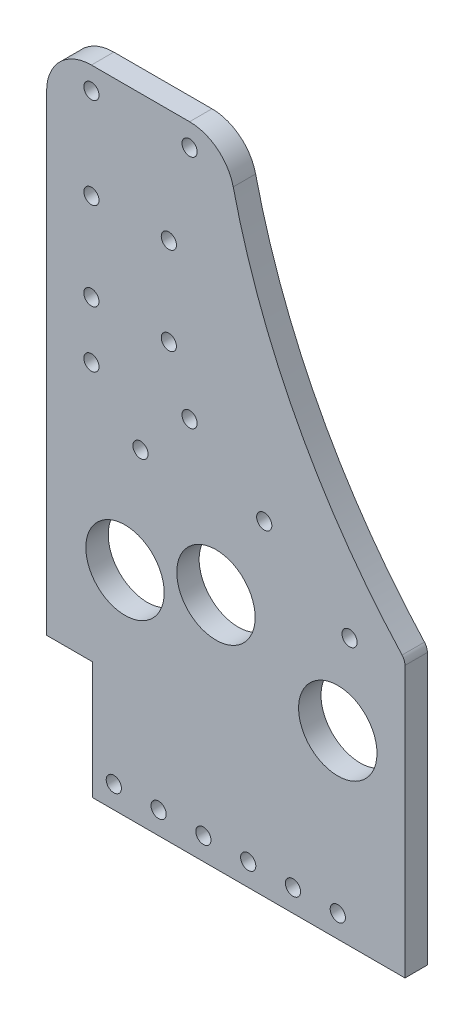
ISO-10303-21;
HEADER;
FILE_DESCRIPTION(('STEP AP214'),'2;1');
FILE_NAME('part.step','',(''),(''),'','','');
FILE_SCHEMA(('AUTOMOTIVE_DESIGN { 1 0 10303 214 1 1 1 1 }'));
ENDSEC;
DATA;
#1=APPLICATION_CONTEXT('core data for automotive mechanical design processes');
#2=APPLICATION_PROTOCOL_DEFINITION('international standard','automotive_design',2000,#1);
#3=PRODUCT_CONTEXT('',#1,'mechanical');
#4=PRODUCT('Part','Part','',(#3));
#5=PRODUCT_RELATED_PRODUCT_CATEGORY('part','',(#4));
#6=PRODUCT_DEFINITION_FORMATION('','',#4);
#7=PRODUCT_DEFINITION_CONTEXT('part definition',#1,'design');
#8=PRODUCT_DEFINITION('design','',#6,#7);
#9=PRODUCT_DEFINITION_SHAPE('','',#8);
#10=(LENGTH_UNIT() NAMED_UNIT(*) SI_UNIT(.MILLI.,.METRE.));
#11=(NAMED_UNIT(*) PLANE_ANGLE_UNIT() SI_UNIT($,.RADIAN.));
#12=(NAMED_UNIT(*) SI_UNIT($,.STERADIAN.) SOLID_ANGLE_UNIT());
#13=UNCERTAINTY_MEASURE_WITH_UNIT(LENGTH_MEASURE(1.E-05),#10,'distance_accuracy_value','');
#14=(GEOMETRIC_REPRESENTATION_CONTEXT(3) GLOBAL_UNCERTAINTY_ASSIGNED_CONTEXT((#13)) GLOBAL_UNIT_ASSIGNED_CONTEXT((#10,
#11,#12)) REPRESENTATION_CONTEXT('',''));
#15=CARTESIAN_POINT('',(0.,0.,0.));
#16=DIRECTION('',(0.,0.,1.));
#17=DIRECTION('',(1.,0.,0.));
#18=AXIS2_PLACEMENT_3D('',#15,#16,#17);
#19=CARTESIAN_POINT('',(46.1010000000001,208.28,-30.1625));
#20=DIRECTION('',(0.,0.,-1.));
#21=DIRECTION('',(-1.,0.,0.));
#22=AXIS2_PLACEMENT_3D('',#19,#20,#21);
#23=PLANE('',#22);
#24=CARTESIAN_POINT('',(68.0526412853853,188.834769871523,-30.1625));
#25=DIRECTION('',(0.,0.,-1.));
#26=DIRECTION('',(-1.,0.,0.));
#27=AXIS2_PLACEMENT_3D('',#24,#25,#26);
#28=CIRCLE('',#27,2.15265000000001);
#29=CARTESIAN_POINT('',(65.8999912853853,188.834769871523,-30.1625));
#30=VERTEX_POINT('',#29);
#31=EDGE_CURVE('E193',#30,#30,#28,.F.);
#32=ORIENTED_EDGE('',*,*,#31,.F.);
#33=EDGE_LOOP('',(#32));
#34=FACE_BOUND('',#33,.T.);
#35=CARTESIAN_POINT('',(68.0526412853853,163.971230128477,-30.1625));
#36=DIRECTION('',(0.,0.,-1.));
#37=DIRECTION('',(-1.,0.,0.));
#38=AXIS2_PLACEMENT_3D('',#35,#36,#37);
#39=CIRCLE('',#38,2.15265000000001);
#40=CARTESIAN_POINT('',(65.8999912853853,163.971230128477,-30.1625));
#41=VERTEX_POINT('',#40);
#42=EDGE_CURVE('E417',#41,#41,#39,.F.);
#43=ORIENTED_EDGE('',*,*,#42,.F.);
#44=EDGE_LOOP('',(#43));
#45=FACE_BOUND('',#44,.T.);
#46=CARTESIAN_POINT('',(46.1010000000002,163.971230128477,-30.1625));
#47=DIRECTION('',(0.,0.,-1.));
#48=DIRECTION('',(-1.,0.,0.));
#49=AXIS2_PLACEMENT_3D('',#46,#47,#48);
#50=CIRCLE('',#49,2.15265);
#51=CARTESIAN_POINT('',(43.9483500000002,163.971230128477,-30.1625));
#52=VERTEX_POINT('',#51);
#53=EDGE_CURVE('E420',#52,#52,#50,.F.);
#54=ORIENTED_EDGE('',*,*,#53,.F.);
#55=EDGE_LOOP('',(#54));
#56=FACE_BOUND('',#55,.T.);
#57=CARTESIAN_POINT('',(46.1010000000002,188.834769871523,-30.1625));
#58=DIRECTION('',(0.,0.,-1.));
#59=DIRECTION('',(-1.,0.,0.));
#60=AXIS2_PLACEMENT_3D('',#57,#58,#59);
#61=CIRCLE('',#60,2.15265);
#62=CARTESIAN_POINT('',(43.9483500000002,188.834769871523,-30.1625));
#63=VERTEX_POINT('',#62);
#64=EDGE_CURVE('E425',#63,#63,#61,.F.);
#65=ORIENTED_EDGE('',*,*,#64,.F.);
#66=EDGE_LOOP('',(#65));
#67=FACE_BOUND('',#66,.T.);
#68=CARTESIAN_POINT('',(52.4510000000001,47.6249999999999,-30.1625));
#69=DIRECTION('',(0.,0.,-1.));
#70=DIRECTION('',(-1.,0.,0.));
#71=AXIS2_PLACEMENT_3D('',#68,#69,#70);
#72=CIRCLE('',#71,2.15265000000001);
#73=CARTESIAN_POINT('',(50.2983500000001,47.6249999999999,-30.1625));
#74=VERTEX_POINT('',#73);
#75=EDGE_CURVE('E229',#74,#74,#72,.T.);
#76=ORIENTED_EDGE('',*,*,#75,.T.);
#77=EDGE_LOOP('',(#76));
#78=FACE_BOUND('',#77,.T.);
#79=CARTESIAN_POINT('',(65.1510000000001,47.6249999999999,-30.1625));
#80=DIRECTION('',(0.,0.,-1.));
#81=DIRECTION('',(-1.,0.,0.));
#82=AXIS2_PLACEMENT_3D('',#79,#80,#81);
#83=CIRCLE('',#82,2.15265000000001);
#84=CARTESIAN_POINT('',(62.9983500000001,47.6249999999999,-30.1625));
#85=VERTEX_POINT('',#84);
#86=EDGE_CURVE('E226',#85,#85,#83,.T.);
#87=ORIENTED_EDGE('',*,*,#86,.T.);
#88=EDGE_LOOP('',(#87));
#89=FACE_BOUND('',#88,.T.);
#90=CARTESIAN_POINT('',(77.8510000000001,47.6249999999999,-30.1625));
#91=DIRECTION('',(0.,0.,-1.));
#92=DIRECTION('',(-1.,0.,0.));
#93=AXIS2_PLACEMENT_3D('',#90,#91,#92);
#94=CIRCLE('',#93,2.15265000000001);
#95=CARTESIAN_POINT('',(75.6983500000001,47.6249999999999,-30.1625));
#96=VERTEX_POINT('',#95);
#97=EDGE_CURVE('E223',#96,#96,#94,.T.);
#98=ORIENTED_EDGE('',*,*,#97,.T.);
#99=EDGE_LOOP('',(#98));
#100=FACE_BOUND('',#99,.T.);
#101=CARTESIAN_POINT('',(90.5510000000001,47.6249999999999,-30.1625));
#102=DIRECTION('',(0.,0.,-1.));
#103=DIRECTION('',(-1.,0.,0.));
#104=AXIS2_PLACEMENT_3D('',#101,#102,#103);
#105=CIRCLE('',#104,2.15265000000001);
#106=CARTESIAN_POINT('',(88.3983500000001,47.6249999999999,-30.1625));
#107=VERTEX_POINT('',#106);
#108=EDGE_CURVE('E220',#107,#107,#105,.T.);
#109=ORIENTED_EDGE('',*,*,#108,.T.);
#110=EDGE_LOOP('',(#109));
#111=FACE_BOUND('',#110,.T.);
#112=CARTESIAN_POINT('',(103.251,47.6249999999999,-30.1625));
#113=DIRECTION('',(0.,0.,-1.));
#114=DIRECTION('',(-1.,0.,0.));
#115=AXIS2_PLACEMENT_3D('',#112,#113,#114);
#116=CIRCLE('',#115,2.15265000000001);
#117=CARTESIAN_POINT('',(101.09835,47.6249999999999,-30.1625));
#118=VERTEX_POINT('',#117);
#119=EDGE_CURVE('E216',#118,#118,#116,.T.);
#120=ORIENTED_EDGE('',*,*,#119,.T.);
#121=EDGE_LOOP('',(#120));
#122=FACE_BOUND('',#121,.T.);
#123=CARTESIAN_POINT('',(115.951,47.6249999999999,-30.1625));
#124=DIRECTION('',(0.,0.,-1.));
#125=DIRECTION('',(-1.,0.,0.));
#126=AXIS2_PLACEMENT_3D('',#123,#124,#125);
#127=CIRCLE('',#126,2.15265000000001);
#128=CARTESIAN_POINT('',(113.79835,47.6249999999999,-30.1625));
#129=VERTEX_POINT('',#128);
#130=EDGE_CURVE('E213',#129,#129,#127,.T.);
#131=ORIENTED_EDGE('',*,*,#130,.T.);
#132=EDGE_LOOP('',(#131));
#133=FACE_BOUND('',#132,.T.);
#134=DIRECTION('',(1.,0.,0.));
#135=VECTOR('',#134,1.);
#136=CARTESIAN_POINT('',(46.3550000000001,74.6125,-30.1625));
#137=LINE('',#136,#135);
#138=CARTESIAN_POINT('',(33.4010000000001,74.6125,-30.1625));
#139=VERTEX_POINT('',#138);
#140=CARTESIAN_POINT('',(46.3550000000001,74.6125,-30.1625));
#141=VERTEX_POINT('',#140);
#142=EDGE_CURVE('E171',#139,#141,#137,.T.);
#143=ORIENTED_EDGE('',*,*,#142,.T.);
#144=DIRECTION('',(0.,-1.,0.));
#145=VECTOR('',#144,1.);
#146=CARTESIAN_POINT('',(46.3550000000001,74.6125,-30.1625));
#147=LINE('',#146,#145);
#148=CARTESIAN_POINT('',(46.3550000000001,41.2749999999999,-30.1625));
#149=VERTEX_POINT('',#148);
#150=EDGE_CURVE('E108',#141,#149,#147,.T.);
#151=ORIENTED_EDGE('',*,*,#150,.T.);
#152=DIRECTION('',(1.,0.,0.));
#153=VECTOR('',#152,1.);
#154=CARTESIAN_POINT('',(46.3550000000001,41.2749999999999,-30.1625));
#155=LINE('',#154,#153);
#156=CARTESIAN_POINT('',(135.001,41.2749999999999,-30.1625));
#157=VERTEX_POINT('',#156);
#158=EDGE_CURVE('E293',#149,#157,#155,.T.);
#159=ORIENTED_EDGE('',*,*,#158,.T.);
#160=DIRECTION('',(0.,1.,0.));
#161=VECTOR('',#160,1.);
#162=CARTESIAN_POINT('',(135.001,73.152,-30.1625));
#163=LINE('',#162,#161);
#164=CARTESIAN_POINT('',(135.001,118.017245544849,-30.1625));
#165=VERTEX_POINT('',#164);
#166=EDGE_CURVE('E295',#157,#165,#163,.T.);
#167=ORIENTED_EDGE('',*,*,#166,.T.);
#168=CARTESIAN_POINT('',(131.826,118.017245544849,-30.1625));
#169=DIRECTION('',(0.,0.,1.));
#170=DIRECTION('',(1.,0.,0.));
#171=AXIS2_PLACEMENT_3D('',#168,#169,#170);
#172=CIRCLE('',#171,3.17500000000004);
#173=CARTESIAN_POINT('',(134.170615384616,120.158134074928,-30.1625));
#174=VERTEX_POINT('',#173);
#175=EDGE_CURVE('E297',#165,#174,#172,.T.);
#176=ORIENTED_EDGE('',*,*,#175,.T.);
#177=CARTESIAN_POINT('',(284.226,257.175,-30.1625));
#178=DIRECTION('',(0.,0.,-1.));
#179=DIRECTION('',(1.,0.,0.));
#180=AXIS2_PLACEMENT_3D('',#177,#178,#179);
#181=CIRCLE('',#180,203.2);
#182=CARTESIAN_POINT('',(86.3055415300155,211.156176470588,-30.1625));
#183=VERTEX_POINT('',#182);
#184=EDGE_CURVE('E299',#174,#183,#181,.T.);
#185=ORIENTED_EDGE('',*,*,#184,.T.);
#186=CARTESIAN_POINT('',(73.9355128756415,208.28,-30.1625));
#187=DIRECTION('',(0.,0.,1.));
#188=DIRECTION('',(1.,0.,0.));
#189=AXIS2_PLACEMENT_3D('',#186,#187,#188);
#190=CIRCLE('',#189,12.7);
#191=CARTESIAN_POINT('',(73.9355128756415,220.98,-30.1625));
#192=VERTEX_POINT('',#191);
#193=EDGE_CURVE('E133',#183,#192,#190,.T.);
#194=ORIENTED_EDGE('',*,*,#193,.T.);
#195=DIRECTION('',(-1.,0.,0.));
#196=VECTOR('',#195,1.);
#197=CARTESIAN_POINT('',(46.1010000000001,220.98,-30.1625));
#198=LINE('',#197,#196);
#199=CARTESIAN_POINT('',(46.1010000000001,220.98,-30.1625));
#200=VERTEX_POINT('',#199);
#201=EDGE_CURVE('E127',#192,#200,#198,.T.);
#202=ORIENTED_EDGE('',*,*,#201,.T.);
#203=CARTESIAN_POINT('',(46.1010000000001,208.28,-30.1625));
#204=DIRECTION('',(0.,0.,1.));
#205=DIRECTION('',(-1.,0.,0.));
#206=AXIS2_PLACEMENT_3D('',#203,#204,#205);
#207=CIRCLE('',#206,12.7);
#208=CARTESIAN_POINT('',(33.4010000000001,208.28,-30.1625));
#209=VERTEX_POINT('',#208);
#210=EDGE_CURVE('E131',#200,#209,#207,.T.);
#211=ORIENTED_EDGE('',*,*,#210,.T.);
#212=DIRECTION('',(0.,-1.,0.));
#213=VECTOR('',#212,1.);
#214=CARTESIAN_POINT('',(33.4010000000001,74.6125,-30.1625));
#215=LINE('',#214,#213);
#216=EDGE_CURVE('E59',#209,#139,#215,.T.);
#217=ORIENTED_EDGE('',*,*,#216,.T.);
#218=EDGE_LOOP('',(#143,#151,#159,#167,#176,#185,#194,#202,#211,#217));
#219=FACE_BOUND('',#218,.T.);
#220=CARTESIAN_POINT('',(55.626,101.727,-30.1625));
#221=DIRECTION('',(0.,0.,1.));
#222=DIRECTION('',(1.,0.,0.));
#223=AXIS2_PLACEMENT_3D('',#220,#221,#222);
#224=CIRCLE('',#223,11.1125);
#225=CARTESIAN_POINT('',(66.7385,101.727,-30.1625));
#226=VERTEX_POINT('',#225);
#227=EDGE_CURVE('E155',#226,#226,#224,.T.);
#228=ORIENTED_EDGE('',*,*,#227,.F.);
#229=EDGE_LOOP('',(#228));
#230=FACE_BOUND('',#229,.T.);
#231=CARTESIAN_POINT('',(81.4091598832877,108.547378760217,-30.1625));
#232=DIRECTION('',(0.,0.,1.));
#233=DIRECTION('',(1.,0.,0.));
#234=AXIS2_PLACEMENT_3D('',#231,#232,#233);
#235=CIRCLE('',#234,11.1125);
#236=CARTESIAN_POINT('',(92.5216598832877,108.547378760217,-30.1625));
#237=VERTEX_POINT('',#236);
#238=EDGE_CURVE('E281',#237,#237,#235,.T.);
#239=ORIENTED_EDGE('',*,*,#238,.F.);
#240=EDGE_LOOP('',(#239));
#241=FACE_BOUND('',#240,.T.);
#242=CARTESIAN_POINT('',(115.951,92.4703367016957,-30.1625));
#243=DIRECTION('',(0.,0.,1.));
#244=DIRECTION('',(1.,0.,0.));
#245=AXIS2_PLACEMENT_3D('',#242,#243,#244);
#246=CIRCLE('',#245,11.1125);
#247=CARTESIAN_POINT('',(127.0635,92.4703367016957,-30.1625));
#248=VERTEX_POINT('',#247);
#249=EDGE_CURVE('E275',#248,#248,#246,.T.);
#250=ORIENTED_EDGE('',*,*,#249,.F.);
#251=EDGE_LOOP('',(#250));
#252=FACE_BOUND('',#251,.T.);
#253=CARTESIAN_POINT('',(46.1010000000001,214.63,-30.1625));
#254=DIRECTION('',(0.,0.,1.));
#255=DIRECTION('',(1.,0.,0.));
#256=AXIS2_PLACEMENT_3D('',#253,#254,#255);
#257=CIRCLE('',#256,2.15265);
#258=CARTESIAN_POINT('',(48.2536500000001,214.63,-30.1625));
#259=VERTEX_POINT('',#258);
#260=EDGE_CURVE('E269',#259,#259,#257,.T.);
#261=ORIENTED_EDGE('',*,*,#260,.F.);
#262=EDGE_LOOP('',(#261));
#263=FACE_BOUND('',#262,.T.);
#264=CARTESIAN_POINT('',(73.9355128756415,214.63,-30.1625));
#265=DIRECTION('',(0.,0.,1.));
#266=DIRECTION('',(1.,0.,0.));
#267=AXIS2_PLACEMENT_3D('',#264,#265,#266);
#268=CIRCLE('',#267,2.15265000000001);
#269=CARTESIAN_POINT('',(76.0881628756415,214.63,-30.1625));
#270=VERTEX_POINT('',#269);
#271=EDGE_CURVE('E263',#270,#270,#268,.T.);
#272=ORIENTED_EDGE('',*,*,#271,.F.);
#273=EDGE_LOOP('',(#272));
#274=FACE_BOUND('',#273,.T.);
#275=CARTESIAN_POINT('',(46.1010000000001,147.955,-30.1625));
#276=DIRECTION('',(0.,0.,1.));
#277=DIRECTION('',(1.,0.,0.));
#278=AXIS2_PLACEMENT_3D('',#275,#276,#277);
#279=CIRCLE('',#278,2.15265);
#280=CARTESIAN_POINT('',(48.2536500000001,147.955,-30.1625));
#281=VERTEX_POINT('',#280);
#282=EDGE_CURVE('E257',#281,#281,#279,.T.);
#283=ORIENTED_EDGE('',*,*,#282,.F.);
#284=EDGE_LOOP('',(#283));
#285=FACE_BOUND('',#284,.T.);
#286=CARTESIAN_POINT('',(73.9355128756415,147.955,-30.1625));
#287=DIRECTION('',(0.,0.,1.));
#288=DIRECTION('',(1.,0.,0.));
#289=AXIS2_PLACEMENT_3D('',#286,#287,#288);
#290=CIRCLE('',#289,2.15265000000001);
#291=CARTESIAN_POINT('',(76.0881628756415,147.955,-30.1625));
#292=VERTEX_POINT('',#291);
#293=EDGE_CURVE('E251',#292,#292,#290,.T.);
#294=ORIENTED_EDGE('',*,*,#293,.F.);
#295=EDGE_LOOP('',(#294));
#296=FACE_BOUND('',#295,.T.);
#297=CARTESIAN_POINT('',(60.0182564378208,133.455471594132,-30.1625));
#298=DIRECTION('',(0.,0.,1.));
#299=DIRECTION('',(1.,0.,0.));
#300=AXIS2_PLACEMENT_3D('',#297,#298,#299);
#301=CIRCLE('',#300,2.15265);
#302=CARTESIAN_POINT('',(62.1709064378208,133.455471594132,-30.1625));
#303=VERTEX_POINT('',#302);
#304=EDGE_CURVE('E245',#303,#303,#301,.T.);
#305=ORIENTED_EDGE('',*,*,#304,.F.);
#306=EDGE_LOOP('',(#305));
#307=FACE_BOUND('',#306,.T.);
#308=CARTESIAN_POINT('',(95.0981871537462,133.455471594132,-30.1625));
#309=DIRECTION('',(0.,0.,1.));
#310=DIRECTION('',(1.,0.,0.));
#311=AXIS2_PLACEMENT_3D('',#308,#309,#310);
#312=CIRCLE('',#311,2.15264999999999);
#313=CARTESIAN_POINT('',(97.2508371537462,133.455471594132,-30.1625));
#314=VERTEX_POINT('',#313);
#315=EDGE_CURVE('E239',#314,#314,#312,.T.);
#316=ORIENTED_EDGE('',*,*,#315,.F.);
#317=EDGE_LOOP('',(#316));
#318=FACE_BOUND('',#317,.T.);
#319=CARTESIAN_POINT('',(119.286745243789,116.882770029357,-30.1625));
#320=DIRECTION('',(0.,0.,1.));
#321=DIRECTION('',(1.,0.,0.));
#322=AXIS2_PLACEMENT_3D('',#319,#320,#321);
#323=CIRCLE('',#322,2.15265000000006);
#324=CARTESIAN_POINT('',(121.439395243789,116.882770029357,-30.1625));
#325=VERTEX_POINT('',#324);
#326=EDGE_CURVE('E233',#325,#325,#323,.T.);
#327=ORIENTED_EDGE('',*,*,#326,.F.);
#328=EDGE_LOOP('',(#327));
#329=FACE_BOUND('',#328,.T.);
#330=ADVANCED_FACE('F40',(#34,#45,#56,#67,#78,#89,#100,#111,#122,#133,#219,#230,#241,#252,#263,
#274,#285,#296,#307,#318,#329),#23,.F.);
#331=CARTESIAN_POINT('',(46.1010000000001,208.28,-36.5125));
#332=DIRECTION('',(0.,0.,-1.));
#333=DIRECTION('',(-1.,0.,0.));
#334=AXIS2_PLACEMENT_3D('',#331,#332,#333);
#335=PLANE('',#334);
#336=CARTESIAN_POINT('',(68.0526412853853,188.834769871523,-36.5125));
#337=DIRECTION('',(0.,0.,-1.));
#338=DIRECTION('',(-1.,0.,0.));
#339=AXIS2_PLACEMENT_3D('',#336,#337,#338);
#340=CIRCLE('',#339,2.15265000000001);
#341=CARTESIAN_POINT('',(65.8999912853853,188.834769871523,-36.5125));
#342=VERTEX_POINT('',#341);
#343=EDGE_CURVE('E44',#342,#342,#340,.T.);
#344=ORIENTED_EDGE('',*,*,#343,.F.);
#345=EDGE_LOOP('',(#344));
#346=FACE_BOUND('',#345,.T.);
#347=CARTESIAN_POINT('',(68.0526412853853,163.971230128477,-36.5125));
#348=DIRECTION('',(0.,0.,-1.));
#349=DIRECTION('',(-1.,0.,0.));
#350=AXIS2_PLACEMENT_3D('',#347,#348,#349);
#351=CIRCLE('',#350,2.15265000000001);
#352=CARTESIAN_POINT('',(65.8999912853853,163.971230128477,-36.5125));
#353=VERTEX_POINT('',#352);
#354=EDGE_CURVE('E195',#353,#353,#351,.T.);
#355=ORIENTED_EDGE('',*,*,#354,.F.);
#356=EDGE_LOOP('',(#355));
#357=FACE_BOUND('',#356,.T.);
#358=CARTESIAN_POINT('',(46.1010000000002,163.971230128477,-36.5125));
#359=DIRECTION('',(0.,0.,-1.));
#360=DIRECTION('',(-1.,0.,0.));
#361=AXIS2_PLACEMENT_3D('',#358,#359,#360);
#362=CIRCLE('',#361,2.15265);
#363=CARTESIAN_POINT('',(43.9483500000002,163.971230128477,-36.5125));
#364=VERTEX_POINT('',#363);
#365=EDGE_CURVE('E192',#364,#364,#362,.T.);
#366=ORIENTED_EDGE('',*,*,#365,.F.);
#367=EDGE_LOOP('',(#366));
#368=FACE_BOUND('',#367,.T.);
#369=CARTESIAN_POINT('',(46.1010000000002,188.834769871523,-36.5125));
#370=DIRECTION('',(0.,0.,-1.));
#371=DIRECTION('',(-1.,0.,0.));
#372=AXIS2_PLACEMENT_3D('',#369,#370,#371);
#373=CIRCLE('',#372,2.15265);
#374=CARTESIAN_POINT('',(43.9483500000002,188.834769871523,-36.5125));
#375=VERTEX_POINT('',#374);
#376=EDGE_CURVE('E189',#375,#375,#373,.T.);
#377=ORIENTED_EDGE('',*,*,#376,.F.);
#378=EDGE_LOOP('',(#377));
#379=FACE_BOUND('',#378,.T.);
#380=CARTESIAN_POINT('',(52.4510000000001,47.6249999999999,-36.5125));
#381=DIRECTION('',(0.,0.,-1.));
#382=DIRECTION('',(-1.,0.,0.));
#383=AXIS2_PLACEMENT_3D('',#380,#381,#382);
#384=CIRCLE('',#383,2.15265000000001);
#385=CARTESIAN_POINT('',(50.2983500000001,47.6249999999999,-36.5125));
#386=VERTEX_POINT('',#385);
#387=EDGE_CURVE('E217',#386,#386,#384,.F.);
#388=ORIENTED_EDGE('',*,*,#387,.T.);
#389=EDGE_LOOP('',(#388));
#390=FACE_BOUND('',#389,.T.);
#391=CARTESIAN_POINT('',(65.1510000000001,47.6249999999999,-36.5125));
#392=DIRECTION('',(0.,0.,-1.));
#393=DIRECTION('',(-1.,0.,0.));
#394=AXIS2_PLACEMENT_3D('',#391,#392,#393);
#395=CIRCLE('',#394,2.15265000000001);
#396=CARTESIAN_POINT('',(62.9983500000001,47.6249999999999,-36.5125));
#397=VERTEX_POINT('',#396);
#398=EDGE_CURVE('E430',#397,#397,#395,.F.);
#399=ORIENTED_EDGE('',*,*,#398,.T.);
#400=EDGE_LOOP('',(#399));
#401=FACE_BOUND('',#400,.T.);
#402=CARTESIAN_POINT('',(77.8510000000001,47.6249999999999,-36.5125));
#403=DIRECTION('',(0.,0.,-1.));
#404=DIRECTION('',(-1.,0.,0.));
#405=AXIS2_PLACEMENT_3D('',#402,#403,#404);
#406=CIRCLE('',#405,2.15265000000001);
#407=CARTESIAN_POINT('',(75.6983500000001,47.6249999999999,-36.5125));
#408=VERTEX_POINT('',#407);
#409=EDGE_CURVE('E433',#408,#408,#406,.F.);
#410=ORIENTED_EDGE('',*,*,#409,.T.);
#411=EDGE_LOOP('',(#410));
#412=FACE_BOUND('',#411,.T.);
#413=CARTESIAN_POINT('',(90.5510000000001,47.6249999999999,-36.5125));
#414=DIRECTION('',(0.,0.,-1.));
#415=DIRECTION('',(-1.,0.,0.));
#416=AXIS2_PLACEMENT_3D('',#413,#414,#415);
#417=CIRCLE('',#416,2.15265000000001);
#418=CARTESIAN_POINT('',(88.3983500000001,47.6249999999999,-36.5125));
#419=VERTEX_POINT('',#418);
#420=EDGE_CURVE('E209',#419,#419,#417,.F.);
#421=ORIENTED_EDGE('',*,*,#420,.T.);
#422=EDGE_LOOP('',(#421));
#423=FACE_BOUND('',#422,.T.);
#424=CARTESIAN_POINT('',(103.251,47.6249999999999,-36.5125));
#425=DIRECTION('',(0.,0.,-1.));
#426=DIRECTION('',(-1.,0.,0.));
#427=AXIS2_PLACEMENT_3D('',#424,#425,#426);
#428=CIRCLE('',#427,2.15265000000001);
#429=CARTESIAN_POINT('',(101.09835,47.6249999999999,-36.5125));
#430=VERTEX_POINT('',#429);
#431=EDGE_CURVE('E204',#430,#430,#428,.F.);
#432=ORIENTED_EDGE('',*,*,#431,.T.);
#433=EDGE_LOOP('',(#432));
#434=FACE_BOUND('',#433,.T.);
#435=CARTESIAN_POINT('',(115.951,47.6249999999999,-36.5125));
#436=DIRECTION('',(0.,0.,-1.));
#437=DIRECTION('',(-1.,0.,0.));
#438=AXIS2_PLACEMENT_3D('',#435,#436,#437);
#439=CIRCLE('',#438,2.15265000000001);
#440=CARTESIAN_POINT('',(113.79835,47.6249999999999,-36.5125));
#441=VERTEX_POINT('',#440);
#442=EDGE_CURVE('E200',#441,#441,#439,.F.);
#443=ORIENTED_EDGE('',*,*,#442,.T.);
#444=EDGE_LOOP('',(#443));
#445=FACE_BOUND('',#444,.T.);
#446=CARTESIAN_POINT('',(95.0981871537462,133.455471594132,-36.5125));
#447=DIRECTION('',(0.,0.,1.));
#448=DIRECTION('',(1.,0.,0.));
#449=AXIS2_PLACEMENT_3D('',#446,#447,#448);
#450=CIRCLE('',#449,2.15264999999999);
#451=CARTESIAN_POINT('',(97.2508371537462,133.455471594132,-36.5125));
#452=VERTEX_POINT('',#451);
#453=EDGE_CURVE('E236',#452,#452,#450,.T.);
#454=ORIENTED_EDGE('',*,*,#453,.T.);
#455=EDGE_LOOP('',(#454));
#456=FACE_BOUND('',#455,.T.);
#457=CARTESIAN_POINT('',(73.9355128756415,147.955,-36.5125));
#458=DIRECTION('',(0.,0.,1.));
#459=DIRECTION('',(1.,0.,0.));
#460=AXIS2_PLACEMENT_3D('',#457,#458,#459);
#461=CIRCLE('',#460,2.15265000000001);
#462=CARTESIAN_POINT('',(76.0881628756415,147.955,-36.5125));
#463=VERTEX_POINT('',#462);
#464=EDGE_CURVE('E248',#463,#463,#461,.T.);
#465=ORIENTED_EDGE('',*,*,#464,.T.);
#466=EDGE_LOOP('',(#465));
#467=FACE_BOUND('',#466,.T.);
#468=CARTESIAN_POINT('',(73.9355128756415,214.63,-36.5125));
#469=DIRECTION('',(0.,0.,1.));
#470=DIRECTION('',(1.,0.,0.));
#471=AXIS2_PLACEMENT_3D('',#468,#469,#470);
#472=CIRCLE('',#471,2.15265000000001);
#473=CARTESIAN_POINT('',(76.0881628756415,214.63,-36.5125));
#474=VERTEX_POINT('',#473);
#475=EDGE_CURVE('E260',#474,#474,#472,.T.);
#476=ORIENTED_EDGE('',*,*,#475,.T.);
#477=EDGE_LOOP('',(#476));
#478=FACE_BOUND('',#477,.T.);
#479=CARTESIAN_POINT('',(115.951,92.4703367016957,-36.5125));
#480=DIRECTION('',(0.,0.,1.));
#481=DIRECTION('',(1.,0.,0.));
#482=AXIS2_PLACEMENT_3D('',#479,#480,#481);
#483=CIRCLE('',#482,11.1125);
#484=CARTESIAN_POINT('',(127.0635,92.4703367016957,-36.5125));
#485=VERTEX_POINT('',#484);
#486=EDGE_CURVE('E272',#485,#485,#483,.T.);
#487=ORIENTED_EDGE('',*,*,#486,.T.);
#488=EDGE_LOOP('',(#487));
#489=FACE_BOUND('',#488,.T.);
#490=CARTESIAN_POINT('',(55.626,101.727,-36.5125));
#491=DIRECTION('',(0.,0.,1.));
#492=DIRECTION('',(1.,0.,0.));
#493=AXIS2_PLACEMENT_3D('',#490,#491,#492);
#494=CIRCLE('',#493,11.1125);
#495=CARTESIAN_POINT('',(66.7385,101.727,-36.5125));
#496=VERTEX_POINT('',#495);
#497=EDGE_CURVE('E284',#496,#496,#494,.T.);
#498=ORIENTED_EDGE('',*,*,#497,.T.);
#499=EDGE_LOOP('',(#498));
#500=FACE_BOUND('',#499,.T.);
#501=DIRECTION('',(1.,0.,0.));
#502=VECTOR('',#501,1.);
#503=CARTESIAN_POINT('',(46.3550000000001,74.6125,-36.5125));
#504=LINE('',#503,#502);
#505=CARTESIAN_POINT('',(33.4010000000001,74.6125,-36.5125));
#506=VERTEX_POINT('',#505);
#507=CARTESIAN_POINT('',(46.3550000000001,74.6125,-36.5125));
#508=VERTEX_POINT('',#507);
#509=EDGE_CURVE('E151',#506,#508,#504,.T.);
#510=ORIENTED_EDGE('',*,*,#509,.F.);
#511=DIRECTION('',(0.,-1.,0.));
#512=VECTOR('',#511,1.);
#513=CARTESIAN_POINT('',(33.4010000000001,74.6125,-36.5125));
#514=LINE('',#513,#512);
#515=CARTESIAN_POINT('',(33.4010000000001,208.28,-36.5125));
#516=VERTEX_POINT('',#515);
#517=EDGE_CURVE('E100',#516,#506,#514,.T.);
#518=ORIENTED_EDGE('',*,*,#517,.F.);
#519=CARTESIAN_POINT('',(46.1010000000001,208.28,-36.5125));
#520=DIRECTION('',(0.,0.,1.));
#521=DIRECTION('',(-1.,0.,0.));
#522=AXIS2_PLACEMENT_3D('',#519,#520,#521);
#523=CIRCLE('',#522,12.7);
#524=CARTESIAN_POINT('',(46.1010000000001,220.98,-36.5125));
#525=VERTEX_POINT('',#524);
#526=EDGE_CURVE('E94',#525,#516,#523,.T.);
#527=ORIENTED_EDGE('',*,*,#526,.F.);
#528=DIRECTION('',(-1.,0.,0.));
#529=VECTOR('',#528,1.);
#530=CARTESIAN_POINT('',(46.1010000000001,220.98,-36.5125));
#531=LINE('',#530,#529);
#532=CARTESIAN_POINT('',(73.9355128756415,220.98,-36.5125));
#533=VERTEX_POINT('',#532);
#534=EDGE_CURVE('E141',#533,#525,#531,.T.);
#535=ORIENTED_EDGE('',*,*,#534,.F.);
#536=CARTESIAN_POINT('',(73.9355128756415,208.28,-36.5125));
#537=DIRECTION('',(0.,0.,1.));
#538=DIRECTION('',(1.,0.,0.));
#539=AXIS2_PLACEMENT_3D('',#536,#537,#538);
#540=CIRCLE('',#539,12.7);
#541=CARTESIAN_POINT('',(86.3055415300155,211.156176470588,-36.5125));
#542=VERTEX_POINT('',#541);
#543=EDGE_CURVE('E166',#542,#533,#540,.T.);
#544=ORIENTED_EDGE('',*,*,#543,.F.);
#545=CARTESIAN_POINT('',(284.226,257.175,-36.5125));
#546=DIRECTION('',(0.,0.,-1.));
#547=DIRECTION('',(1.,0.,0.));
#548=AXIS2_PLACEMENT_3D('',#545,#546,#547);
#549=CIRCLE('',#548,203.2);
#550=CARTESIAN_POINT('',(134.170615384616,120.158134074928,-36.5125));
#551=VERTEX_POINT('',#550);
#552=EDGE_CURVE('E164',#551,#542,#549,.T.);
#553=ORIENTED_EDGE('',*,*,#552,.F.);
#554=CARTESIAN_POINT('',(131.826,118.017245544849,-36.5125));
#555=DIRECTION('',(0.,0.,1.));
#556=DIRECTION('',(1.,0.,0.));
#557=AXIS2_PLACEMENT_3D('',#554,#555,#556);
#558=CIRCLE('',#557,3.17500000000004);
#559=CARTESIAN_POINT('',(135.001,118.017245544849,-36.5125));
#560=VERTEX_POINT('',#559);
#561=EDGE_CURVE('E162',#560,#551,#558,.T.);
#562=ORIENTED_EDGE('',*,*,#561,.F.);
#563=DIRECTION('',(0.,1.,0.));
#564=VECTOR('',#563,1.);
#565=CARTESIAN_POINT('',(135.001,118.017245544849,-36.5125));
#566=LINE('',#565,#564);
#567=CARTESIAN_POINT('',(135.001,41.2749999999999,-36.5125));
#568=VERTEX_POINT('',#567);
#569=EDGE_CURVE('E160',#568,#560,#566,.T.);
#570=ORIENTED_EDGE('',*,*,#569,.F.);
#571=DIRECTION('',(1.,0.,0.));
#572=VECTOR('',#571,1.);
#573=CARTESIAN_POINT('',(46.3550000000001,41.2749999999999,-36.5125));
#574=LINE('',#573,#572);
#575=CARTESIAN_POINT('',(46.3550000000001,41.2749999999999,-36.5125));
#576=VERTEX_POINT('',#575);
#577=EDGE_CURVE('E157',#576,#568,#574,.T.);
#578=ORIENTED_EDGE('',*,*,#577,.F.);
#579=DIRECTION('',(0.,-1.,0.));
#580=VECTOR('',#579,1.);
#581=CARTESIAN_POINT('',(46.3550000000001,74.6125,-36.5125));
#582=LINE('',#581,#580);
#583=EDGE_CURVE('E154',#508,#576,#582,.T.);
#584=ORIENTED_EDGE('',*,*,#583,.F.);
#585=EDGE_LOOP('',(#510,#518,#527,#535,#544,#553,#562,#570,#578,#584));
#586=FACE_BOUND('',#585,.T.);
#587=CARTESIAN_POINT('',(81.4091598832877,108.547378760217,-36.5125));
#588=DIRECTION('',(0.,0.,1.));
#589=DIRECTION('',(1.,0.,0.));
#590=AXIS2_PLACEMENT_3D('',#587,#588,#589);
#591=CIRCLE('',#590,11.1125);
#592=CARTESIAN_POINT('',(92.5216598832877,108.547378760217,-36.5125));
#593=VERTEX_POINT('',#592);
#594=EDGE_CURVE('E278',#593,#593,#591,.T.);
#595=ORIENTED_EDGE('',*,*,#594,.T.);
#596=EDGE_LOOP('',(#595));
#597=FACE_BOUND('',#596,.T.);
#598=CARTESIAN_POINT('',(46.1010000000001,214.63,-36.5125));
#599=DIRECTION('',(0.,0.,1.));
#600=DIRECTION('',(1.,0.,0.));
#601=AXIS2_PLACEMENT_3D('',#598,#599,#600);
#602=CIRCLE('',#601,2.15265);
#603=CARTESIAN_POINT('',(48.2536500000001,214.63,-36.5125));
#604=VERTEX_POINT('',#603);
#605=EDGE_CURVE('E266',#604,#604,#602,.T.);
#606=ORIENTED_EDGE('',*,*,#605,.T.);
#607=EDGE_LOOP('',(#606));
#608=FACE_BOUND('',#607,.T.);
#609=CARTESIAN_POINT('',(46.1010000000001,147.955,-36.5125));
#610=DIRECTION('',(0.,0.,1.));
#611=DIRECTION('',(1.,0.,0.));
#612=AXIS2_PLACEMENT_3D('',#609,#610,#611);
#613=CIRCLE('',#612,2.15265);
#614=CARTESIAN_POINT('',(48.2536500000001,147.955,-36.5125));
#615=VERTEX_POINT('',#614);
#616=EDGE_CURVE('E254',#615,#615,#613,.T.);
#617=ORIENTED_EDGE('',*,*,#616,.T.);
#618=EDGE_LOOP('',(#617));
#619=FACE_BOUND('',#618,.T.);
#620=CARTESIAN_POINT('',(60.0182564378208,133.455471594132,-36.5125));
#621=DIRECTION('',(0.,0.,1.));
#622=DIRECTION('',(1.,0.,0.));
#623=AXIS2_PLACEMENT_3D('',#620,#621,#622);
#624=CIRCLE('',#623,2.15265);
#625=CARTESIAN_POINT('',(62.1709064378208,133.455471594132,-36.5125));
#626=VERTEX_POINT('',#625);
#627=EDGE_CURVE('E242',#626,#626,#624,.T.);
#628=ORIENTED_EDGE('',*,*,#627,.T.);
#629=EDGE_LOOP('',(#628));
#630=FACE_BOUND('',#629,.T.);
#631=CARTESIAN_POINT('',(119.286745243789,116.882770029357,-36.5125));
#632=DIRECTION('',(0.,0.,1.));
#633=DIRECTION('',(1.,0.,0.));
#634=AXIS2_PLACEMENT_3D('',#631,#632,#633);
#635=CIRCLE('',#634,2.15265000000006);
#636=CARTESIAN_POINT('',(121.439395243789,116.882770029357,-36.5125));
#637=VERTEX_POINT('',#636);
#638=EDGE_CURVE('E232',#637,#637,#635,.T.);
#639=ORIENTED_EDGE('',*,*,#638,.T.);
#640=EDGE_LOOP('',(#639));
#641=FACE_BOUND('',#640,.T.);
#642=ADVANCED_FACE('F312',(#346,#357,#368,#379,#390,#401,#412,#423,#434,#445,#456,#467,#478,
#489,#500,#586,#597,#608,#619,#630,#641),#335,.T.);
#643=CARTESIAN_POINT('',(46.3550000000001,74.6125,-30.1625));
#644=DIRECTION('',(0.,1.,0.));
#645=DIRECTION('',(-1.,0.,0.));
#646=AXIS2_PLACEMENT_3D('',#643,#644,#645);
#647=PLANE('',#646);
#648=ORIENTED_EDGE('',*,*,#509,.T.);
#649=DIRECTION('',(0.,0.,-1.));
#650=VECTOR('',#649,1.);
#651=CARTESIAN_POINT('',(46.3550000000001,74.6125,-30.1625));
#652=LINE('',#651,#650);
#653=EDGE_CURVE('E11',#141,#508,#652,.T.);
#654=ORIENTED_EDGE('',*,*,#653,.F.);
#655=ORIENTED_EDGE('',*,*,#142,.F.);
#656=DIRECTION('',(0.,0.,-1.));
#657=VECTOR('',#656,1.);
#658=CARTESIAN_POINT('',(33.4010000000001,74.6125,-30.1625));
#659=LINE('',#658,#657);
#660=EDGE_CURVE('E147',#139,#506,#659,.T.);
#661=ORIENTED_EDGE('',*,*,#660,.T.);
#662=EDGE_LOOP('',(#648,#654,#655,#661));
#663=FACE_BOUND('',#662,.T.);
#664=ADVANCED_FACE('F42',(#663),#647,.F.);
#665=CARTESIAN_POINT('',(46.3550000000001,74.6125,-30.1625));
#666=DIRECTION('',(1.,0.,0.));
#667=DIRECTION('',(0.,1.,0.));
#668=AXIS2_PLACEMENT_3D('',#665,#666,#667);
#669=PLANE('',#668);
#670=ORIENTED_EDGE('',*,*,#583,.T.);
#671=DIRECTION('',(0.,0.,-1.));
#672=VECTOR('',#671,1.);
#673=CARTESIAN_POINT('',(46.3550000000001,41.2749999999999,-30.1625));
#674=LINE('',#673,#672);
#675=EDGE_CURVE('E50',#149,#576,#674,.T.);
#676=ORIENTED_EDGE('',*,*,#675,.F.);
#677=ORIENTED_EDGE('',*,*,#150,.F.);
#678=ORIENTED_EDGE('',*,*,#653,.T.);
#679=EDGE_LOOP('',(#670,#676,#677,#678));
#680=FACE_BOUND('',#679,.T.);
#681=ADVANCED_FACE('F655',(#680),#669,.F.);
#682=CARTESIAN_POINT('',(46.3550000000001,41.2749999999999,-30.1625));
#683=DIRECTION('',(0.,1.,0.));
#684=DIRECTION('',(0.,0.,1.));
#685=AXIS2_PLACEMENT_3D('',#682,#683,#684);
#686=PLANE('',#685);
#687=ORIENTED_EDGE('',*,*,#577,.T.);
#688=DIRECTION('',(0.,0.,-1.));
#689=VECTOR('',#688,1.);
#690=CARTESIAN_POINT('',(135.001,41.2749999999999,-30.1625));
#691=LINE('',#690,#689);
#692=EDGE_CURVE('E184',#157,#568,#691,.T.);
#693=ORIENTED_EDGE('',*,*,#692,.F.);
#694=ORIENTED_EDGE('',*,*,#158,.F.);
#695=ORIENTED_EDGE('',*,*,#675,.T.);
#696=EDGE_LOOP('',(#687,#693,#694,#695));
#697=FACE_BOUND('',#696,.T.);
#698=ADVANCED_FACE('F645',(#697),#686,.F.);
#699=CARTESIAN_POINT('',(135.001,118.017245544849,-30.1625));
#700=DIRECTION('',(-1.,0.,0.));
#701=DIRECTION('',(0.,0.,1.));
#702=AXIS2_PLACEMENT_3D('',#699,#700,#701);
#703=PLANE('',#702);
#704=ORIENTED_EDGE('',*,*,#569,.T.);
#705=DIRECTION('',(0.,0.,-1.));
#706=VECTOR('',#705,1.);
#707=CARTESIAN_POINT('',(135.001,118.017245544849,-30.1625));
#708=LINE('',#707,#706);
#709=EDGE_CURVE('E181',#165,#560,#708,.T.);
#710=ORIENTED_EDGE('',*,*,#709,.F.);
#711=ORIENTED_EDGE('',*,*,#166,.F.);
#712=ORIENTED_EDGE('',*,*,#692,.T.);
#713=EDGE_LOOP('',(#704,#710,#711,#712));
#714=FACE_BOUND('',#713,.T.);
#715=ADVANCED_FACE('F634',(#714),#703,.F.);
#716=CARTESIAN_POINT('',(131.826,118.017245544849,-30.1625));
#717=DIRECTION('',(0.,0.,-1.));
#718=DIRECTION('',(-1.,0.,0.));
#719=AXIS2_PLACEMENT_3D('',#716,#717,#718);
#720=CYLINDRICAL_SURFACE('',#719,3.17500000000004);
#721=ORIENTED_EDGE('',*,*,#561,.T.);
#722=DIRECTION('',(0.,0.,-1.));
#723=VECTOR('',#722,1.);
#724=CARTESIAN_POINT('',(134.170615384616,120.158134074928,-30.1625));
#725=LINE('',#724,#723);
#726=EDGE_CURVE('E178',#174,#551,#725,.T.);
#727=ORIENTED_EDGE('',*,*,#726,.F.);
#728=ORIENTED_EDGE('',*,*,#175,.F.);
#729=ORIENTED_EDGE('',*,*,#709,.T.);
#730=EDGE_LOOP('',(#721,#727,#728,#729));
#731=FACE_BOUND('',#730,.T.);
#732=ADVANCED_FACE('F624',(#731),#720,.T.);
#733=CARTESIAN_POINT('',(284.226,257.175,-30.1625));
#734=DIRECTION('',(0.,0.,-1.));
#735=DIRECTION('',(-1.,0.,0.));
#736=AXIS2_PLACEMENT_3D('',#733,#734,#735);
#737=CYLINDRICAL_SURFACE('',#736,203.2);
#738=ORIENTED_EDGE('',*,*,#552,.T.);
#739=DIRECTION('',(0.,0.,-1.));
#740=VECTOR('',#739,1.);
#741=CARTESIAN_POINT('',(86.3055415300155,211.156176470588,-30.1625));
#742=LINE('',#741,#740);
#743=EDGE_CURVE('E175',#183,#542,#742,.T.);
#744=ORIENTED_EDGE('',*,*,#743,.F.);
#745=ORIENTED_EDGE('',*,*,#184,.F.);
#746=ORIENTED_EDGE('',*,*,#726,.T.);
#747=EDGE_LOOP('',(#738,#744,#745,#746));
#748=FACE_BOUND('',#747,.T.);
#749=ADVANCED_FACE('F305',(#748),#737,.F.);
#750=CARTESIAN_POINT('',(73.9355128756415,208.28,-30.1625));
#751=DIRECTION('',(0.,0.,-1.));
#752=DIRECTION('',(-1.,0.,0.));
#753=AXIS2_PLACEMENT_3D('',#750,#751,#752);
#754=CYLINDRICAL_SURFACE('',#753,12.7);
#755=ORIENTED_EDGE('',*,*,#543,.T.);
#756=DIRECTION('',(0.,0.,-1.));
#757=VECTOR('',#756,1.);
#758=CARTESIAN_POINT('',(73.9355128756415,220.98,-30.1625));
#759=LINE('',#758,#757);
#760=EDGE_CURVE('E142',#192,#533,#759,.T.);
#761=ORIENTED_EDGE('',*,*,#760,.F.);
#762=ORIENTED_EDGE('',*,*,#193,.F.);
#763=ORIENTED_EDGE('',*,*,#743,.T.);
#764=EDGE_LOOP('',(#755,#761,#762,#763));
#765=FACE_BOUND('',#764,.T.);
#766=ADVANCED_FACE('F309',(#765),#754,.T.);
#767=CARTESIAN_POINT('',(46.1010000000001,220.98,-30.1625));
#768=DIRECTION('',(0.,-1.,0.));
#769=DIRECTION('',(0.,0.,-1.));
#770=AXIS2_PLACEMENT_3D('',#767,#768,#769);
#771=PLANE('',#770);
#772=ORIENTED_EDGE('',*,*,#534,.T.);
#773=DIRECTION('',(0.,0.,-1.));
#774=VECTOR('',#773,1.);
#775=CARTESIAN_POINT('',(46.1010000000001,220.98,-30.1625));
#776=LINE('',#775,#774);
#777=EDGE_CURVE('E138',#200,#525,#776,.T.);
#778=ORIENTED_EDGE('',*,*,#777,.F.);
#779=ORIENTED_EDGE('',*,*,#201,.F.);
#780=ORIENTED_EDGE('',*,*,#760,.T.);
#781=EDGE_LOOP('',(#772,#778,#779,#780));
#782=FACE_BOUND('',#781,.T.);
#783=ADVANCED_FACE('F139',(#782),#771,.F.);
#784=CARTESIAN_POINT('',(46.1010000000001,208.28,-30.1625));
#785=DIRECTION('',(0.,0.,-1.));
#786=DIRECTION('',(-1.,0.,0.));
#787=AXIS2_PLACEMENT_3D('',#784,#785,#786);
#788=CYLINDRICAL_SURFACE('',#787,12.7);
#789=ORIENTED_EDGE('',*,*,#526,.T.);
#790=DIRECTION('',(0.,0.,-1.));
#791=VECTOR('',#790,1.);
#792=CARTESIAN_POINT('',(33.4010000000001,208.28,-30.1625));
#793=LINE('',#792,#791);
#794=EDGE_CURVE('E143',#209,#516,#793,.T.);
#795=ORIENTED_EDGE('',*,*,#794,.F.);
#796=ORIENTED_EDGE('',*,*,#210,.F.);
#797=ORIENTED_EDGE('',*,*,#777,.T.);
#798=EDGE_LOOP('',(#789,#795,#796,#797));
#799=FACE_BOUND('',#798,.T.);
#800=ADVANCED_FACE('F145',(#799),#788,.T.);
#801=CARTESIAN_POINT('',(33.4010000000001,74.6125,-30.1625));
#802=DIRECTION('',(1.,0.,0.));
#803=DIRECTION('',(0.,0.,-1.));
#804=AXIS2_PLACEMENT_3D('',#801,#802,#803);
#805=PLANE('',#804);
#806=ORIENTED_EDGE('',*,*,#517,.T.);
#807=ORIENTED_EDGE('',*,*,#660,.F.);
#808=ORIENTED_EDGE('',*,*,#216,.F.);
#809=ORIENTED_EDGE('',*,*,#794,.T.);
#810=EDGE_LOOP('',(#806,#807,#808,#809));
#811=FACE_BOUND('',#810,.T.);
#812=ADVANCED_FACE('F318',(#811),#805,.F.);
#813=CARTESIAN_POINT('',(55.626,101.727,-30.1625));
#814=DIRECTION('',(0.,0.,-1.));
#815=DIRECTION('',(-1.,0.,0.));
#816=AXIS2_PLACEMENT_3D('',#813,#814,#815);
#817=CYLINDRICAL_SURFACE('',#816,11.1125);
#818=ORIENTED_EDGE('',*,*,#227,.T.);
#819=EDGE_LOOP('',(#818));
#820=FACE_BOUND('',#819,.T.);
#821=ORIENTED_EDGE('',*,*,#497,.F.);
#822=EDGE_LOOP('',(#821));
#823=FACE_BOUND('',#822,.T.);
#824=ADVANCED_FACE('F320',(#820,#823),#817,.F.);
#825=CARTESIAN_POINT('',(81.4091598832877,108.547378760217,-30.1625));
#826=DIRECTION('',(0.,0.,-1.));
#827=DIRECTION('',(-1.,0.,0.));
#828=AXIS2_PLACEMENT_3D('',#825,#826,#827);
#829=CYLINDRICAL_SURFACE('',#828,11.1125);
#830=ORIENTED_EDGE('',*,*,#238,.T.);
#831=EDGE_LOOP('',(#830));
#832=FACE_BOUND('',#831,.T.);
#833=ORIENTED_EDGE('',*,*,#594,.F.);
#834=EDGE_LOOP('',(#833));
#835=FACE_BOUND('',#834,.T.);
#836=ADVANCED_FACE('F326',(#832,#835),#829,.F.);
#837=CARTESIAN_POINT('',(115.951,92.4703367016957,-30.1625));
#838=DIRECTION('',(0.,0.,-1.));
#839=DIRECTION('',(-1.,0.,0.));
#840=AXIS2_PLACEMENT_3D('',#837,#838,#839);
#841=CYLINDRICAL_SURFACE('',#840,11.1125);
#842=ORIENTED_EDGE('',*,*,#249,.T.);
#843=EDGE_LOOP('',(#842));
#844=FACE_BOUND('',#843,.T.);
#845=ORIENTED_EDGE('',*,*,#486,.F.);
#846=EDGE_LOOP('',(#845));
#847=FACE_BOUND('',#846,.T.);
#848=ADVANCED_FACE('F343',(#844,#847),#841,.F.);
#849=CARTESIAN_POINT('',(46.1010000000001,214.63,-30.1625));
#850=DIRECTION('',(0.,0.,-1.));
#851=DIRECTION('',(-1.,0.,0.));
#852=AXIS2_PLACEMENT_3D('',#849,#850,#851);
#853=CYLINDRICAL_SURFACE('',#852,2.15265);
#854=ORIENTED_EDGE('',*,*,#260,.T.);
#855=EDGE_LOOP('',(#854));
#856=FACE_BOUND('',#855,.T.);
#857=ORIENTED_EDGE('',*,*,#605,.F.);
#858=EDGE_LOOP('',(#857));
#859=FACE_BOUND('',#858,.T.);
#860=ADVANCED_FACE('F347',(#856,#859),#853,.F.);
#861=CARTESIAN_POINT('',(73.9355128756415,214.63,-30.1625));
#862=DIRECTION('',(0.,0.,-1.));
#863=DIRECTION('',(-1.,0.,0.));
#864=AXIS2_PLACEMENT_3D('',#861,#862,#863);
#865=CYLINDRICAL_SURFACE('',#864,2.15265000000001);
#866=ORIENTED_EDGE('',*,*,#271,.T.);
#867=EDGE_LOOP('',(#866));
#868=FACE_BOUND('',#867,.T.);
#869=ORIENTED_EDGE('',*,*,#475,.F.);
#870=EDGE_LOOP('',(#869));
#871=FACE_BOUND('',#870,.T.);
#872=ADVANCED_FACE('F351',(#868,#871),#865,.F.);
#873=CARTESIAN_POINT('',(46.1010000000001,147.955,-30.1625));
#874=DIRECTION('',(0.,0.,-1.));
#875=DIRECTION('',(-1.,0.,0.));
#876=AXIS2_PLACEMENT_3D('',#873,#874,#875);
#877=CYLINDRICAL_SURFACE('',#876,2.15265);
#878=ORIENTED_EDGE('',*,*,#282,.T.);
#879=EDGE_LOOP('',(#878));
#880=FACE_BOUND('',#879,.T.);
#881=ORIENTED_EDGE('',*,*,#616,.F.);
#882=EDGE_LOOP('',(#881));
#883=FACE_BOUND('',#882,.T.);
#884=ADVANCED_FACE('F355',(#880,#883),#877,.F.);
#885=CARTESIAN_POINT('',(73.9355128756415,147.955,-30.1625));
#886=DIRECTION('',(0.,0.,-1.));
#887=DIRECTION('',(-1.,0.,0.));
#888=AXIS2_PLACEMENT_3D('',#885,#886,#887);
#889=CYLINDRICAL_SURFACE('',#888,2.15265000000001);
#890=ORIENTED_EDGE('',*,*,#293,.T.);
#891=EDGE_LOOP('',(#890));
#892=FACE_BOUND('',#891,.T.);
#893=ORIENTED_EDGE('',*,*,#464,.F.);
#894=EDGE_LOOP('',(#893));
#895=FACE_BOUND('',#894,.T.);
#896=ADVANCED_FACE('F359',(#892,#895),#889,.F.);
#897=CARTESIAN_POINT('',(60.0182564378208,133.455471594132,-30.1625));
#898=DIRECTION('',(0.,0.,-1.));
#899=DIRECTION('',(-1.,0.,0.));
#900=AXIS2_PLACEMENT_3D('',#897,#898,#899);
#901=CYLINDRICAL_SURFACE('',#900,2.15265);
#902=ORIENTED_EDGE('',*,*,#304,.T.);
#903=EDGE_LOOP('',(#902));
#904=FACE_BOUND('',#903,.T.);
#905=ORIENTED_EDGE('',*,*,#627,.F.);
#906=EDGE_LOOP('',(#905));
#907=FACE_BOUND('',#906,.T.);
#908=ADVANCED_FACE('F363',(#904,#907),#901,.F.);
#909=CARTESIAN_POINT('',(95.0981871537462,133.455471594132,-30.1625));
#910=DIRECTION('',(0.,0.,-1.));
#911=DIRECTION('',(-1.,0.,0.));
#912=AXIS2_PLACEMENT_3D('',#909,#910,#911);
#913=CYLINDRICAL_SURFACE('',#912,2.15264999999999);
#914=ORIENTED_EDGE('',*,*,#315,.T.);
#915=EDGE_LOOP('',(#914));
#916=FACE_BOUND('',#915,.T.);
#917=ORIENTED_EDGE('',*,*,#453,.F.);
#918=EDGE_LOOP('',(#917));
#919=FACE_BOUND('',#918,.T.);
#920=ADVANCED_FACE('F367',(#916,#919),#913,.F.);
#921=CARTESIAN_POINT('',(119.286745243789,116.882770029357,-30.1625));
#922=DIRECTION('',(0.,0.,-1.));
#923=DIRECTION('',(-1.,0.,0.));
#924=AXIS2_PLACEMENT_3D('',#921,#922,#923);
#925=CYLINDRICAL_SURFACE('',#924,2.15265000000006);
#926=ORIENTED_EDGE('',*,*,#326,.T.);
#927=EDGE_LOOP('',(#926));
#928=FACE_BOUND('',#927,.T.);
#929=ORIENTED_EDGE('',*,*,#638,.F.);
#930=EDGE_LOOP('',(#929));
#931=FACE_BOUND('',#930,.T.);
#932=ADVANCED_FACE('F371',(#928,#931),#925,.F.);
#933=CARTESIAN_POINT('',(115.951,47.6249999999999,-42.6011136500849));
#934=DIRECTION('',(0.,0.,1.));
#935=DIRECTION('',(1.,0.,0.));
#936=AXIS2_PLACEMENT_3D('',#933,#934,#935);
#937=CYLINDRICAL_SURFACE('',#936,2.15265000000001);
#938=ORIENTED_EDGE('',*,*,#442,.F.);
#939=EDGE_LOOP('',(#938));
#940=FACE_BOUND('',#939,.T.);
#941=ORIENTED_EDGE('',*,*,#130,.F.);
#942=EDGE_LOOP('',(#941));
#943=FACE_BOUND('',#942,.T.);
#944=ADVANCED_FACE('F375',(#940,#943),#937,.F.);
#945=CARTESIAN_POINT('',(103.251,47.6249999999999,-42.6011136500849));
#946=DIRECTION('',(0.,0.,1.));
#947=DIRECTION('',(1.,0.,0.));
#948=AXIS2_PLACEMENT_3D('',#945,#946,#947);
#949=CYLINDRICAL_SURFACE('',#948,2.15265000000001);
#950=ORIENTED_EDGE('',*,*,#431,.F.);
#951=EDGE_LOOP('',(#950));
#952=FACE_BOUND('',#951,.T.);
#953=ORIENTED_EDGE('',*,*,#119,.F.);
#954=EDGE_LOOP('',(#953));
#955=FACE_BOUND('',#954,.T.);
#956=ADVANCED_FACE('F379',(#952,#955),#949,.F.);
#957=CARTESIAN_POINT('',(90.5510000000001,47.6249999999999,-42.6011136500849));
#958=DIRECTION('',(0.,0.,1.));
#959=DIRECTION('',(1.,0.,0.));
#960=AXIS2_PLACEMENT_3D('',#957,#958,#959);
#961=CYLINDRICAL_SURFACE('',#960,2.15265000000001);
#962=ORIENTED_EDGE('',*,*,#420,.F.);
#963=EDGE_LOOP('',(#962));
#964=FACE_BOUND('',#963,.T.);
#965=ORIENTED_EDGE('',*,*,#108,.F.);
#966=EDGE_LOOP('',(#965));
#967=FACE_BOUND('',#966,.T.);
#968=ADVANCED_FACE('F383',(#964,#967),#961,.F.);
#969=CARTESIAN_POINT('',(77.8510000000001,47.6249999999999,-42.6011136500849));
#970=DIRECTION('',(0.,0.,1.));
#971=DIRECTION('',(1.,0.,0.));
#972=AXIS2_PLACEMENT_3D('',#969,#970,#971);
#973=CYLINDRICAL_SURFACE('',#972,2.15265000000001);
#974=ORIENTED_EDGE('',*,*,#409,.F.);
#975=EDGE_LOOP('',(#974));
#976=FACE_BOUND('',#975,.T.);
#977=ORIENTED_EDGE('',*,*,#97,.F.);
#978=EDGE_LOOP('',(#977));
#979=FACE_BOUND('',#978,.T.);
#980=ADVANCED_FACE('F387',(#976,#979),#973,.F.);
#981=CARTESIAN_POINT('',(65.1510000000001,47.6249999999999,-42.6011136500849));
#982=DIRECTION('',(0.,0.,1.));
#983=DIRECTION('',(1.,0.,0.));
#984=AXIS2_PLACEMENT_3D('',#981,#982,#983);
#985=CYLINDRICAL_SURFACE('',#984,2.15265000000001);
#986=ORIENTED_EDGE('',*,*,#398,.F.);
#987=EDGE_LOOP('',(#986));
#988=FACE_BOUND('',#987,.T.);
#989=ORIENTED_EDGE('',*,*,#86,.F.);
#990=EDGE_LOOP('',(#989));
#991=FACE_BOUND('',#990,.T.);
#992=ADVANCED_FACE('F391',(#988,#991),#985,.F.);
#993=CARTESIAN_POINT('',(52.4510000000001,47.6249999999999,-42.6011136500849));
#994=DIRECTION('',(0.,0.,1.));
#995=DIRECTION('',(1.,0.,0.));
#996=AXIS2_PLACEMENT_3D('',#993,#994,#995);
#997=CYLINDRICAL_SURFACE('',#996,2.15265000000001);
#998=ORIENTED_EDGE('',*,*,#387,.F.);
#999=EDGE_LOOP('',(#998));
#1000=FACE_BOUND('',#999,.T.);
#1001=ORIENTED_EDGE('',*,*,#75,.F.);
#1002=EDGE_LOOP('',(#1001));
#1003=FACE_BOUND('',#1002,.T.);
#1004=ADVANCED_FACE('F395',(#1000,#1003),#997,.F.);
#1005=CARTESIAN_POINT('',(46.1010000000002,188.834769871523,-24.0738863499151));
#1006=DIRECTION('',(0.,0.,-1.));
#1007=DIRECTION('',(-1.,0.,0.));
#1008=AXIS2_PLACEMENT_3D('',#1005,#1006,#1007);
#1009=CYLINDRICAL_SURFACE('',#1008,2.15265);
#1010=ORIENTED_EDGE('',*,*,#376,.T.);
#1011=EDGE_LOOP('',(#1010));
#1012=FACE_BOUND('',#1011,.T.);
#1013=ORIENTED_EDGE('',*,*,#64,.T.);
#1014=EDGE_LOOP('',(#1013));
#1015=FACE_BOUND('',#1014,.T.);
#1016=ADVANCED_FACE('F399',(#1012,#1015),#1009,.F.);
#1017=CARTESIAN_POINT('',(46.1010000000002,163.971230128477,-24.0738863499151));
#1018=DIRECTION('',(0.,0.,-1.));
#1019=DIRECTION('',(-1.,0.,0.));
#1020=AXIS2_PLACEMENT_3D('',#1017,#1018,#1019);
#1021=CYLINDRICAL_SURFACE('',#1020,2.15265);
#1022=ORIENTED_EDGE('',*,*,#365,.T.);
#1023=EDGE_LOOP('',(#1022));
#1024=FACE_BOUND('',#1023,.T.);
#1025=ORIENTED_EDGE('',*,*,#53,.T.);
#1026=EDGE_LOOP('',(#1025));
#1027=FACE_BOUND('',#1026,.T.);
#1028=ADVANCED_FACE('F403',(#1024,#1027),#1021,.F.);
#1029=CARTESIAN_POINT('',(68.0526412853853,163.971230128477,-24.0738863499151));
#1030=DIRECTION('',(0.,0.,-1.));
#1031=DIRECTION('',(-1.,0.,0.));
#1032=AXIS2_PLACEMENT_3D('',#1029,#1030,#1031);
#1033=CYLINDRICAL_SURFACE('',#1032,2.15265000000001);
#1034=ORIENTED_EDGE('',*,*,#354,.T.);
#1035=EDGE_LOOP('',(#1034));
#1036=FACE_BOUND('',#1035,.T.);
#1037=ORIENTED_EDGE('',*,*,#42,.T.);
#1038=EDGE_LOOP('',(#1037));
#1039=FACE_BOUND('',#1038,.T.);
#1040=ADVANCED_FACE('F407',(#1036,#1039),#1033,.F.);
#1041=CARTESIAN_POINT('',(68.0526412853853,188.834769871523,-24.0738863499151));
#1042=DIRECTION('',(0.,0.,-1.));
#1043=DIRECTION('',(-1.,0.,0.));
#1044=AXIS2_PLACEMENT_3D('',#1041,#1042,#1043);
#1045=CYLINDRICAL_SURFACE('',#1044,2.15265000000001);
#1046=ORIENTED_EDGE('',*,*,#343,.T.);
#1047=EDGE_LOOP('',(#1046));
#1048=FACE_BOUND('',#1047,.T.);
#1049=ORIENTED_EDGE('',*,*,#31,.T.);
#1050=EDGE_LOOP('',(#1049));
#1051=FACE_BOUND('',#1050,.T.);
#1052=ADVANCED_FACE('F411',(#1048,#1051),#1045,.F.);
#1053=CLOSED_SHELL('',(#330,#642,#664,#681,#698,#715,#732,#749,#766,#783,#800,#812,#824,#836,
#848,#860,#872,#884,#896,#908,#920,#932,#944,#956,#968,#980,#992,#1004,#1016,#1028,#1040,#1052));
#1054=MANIFOLD_SOLID_BREP('B2',#1053);
#1055=ADVANCED_BREP_SHAPE_REPRESENTATION('',(#18,#1054),#14);
#1056=SHAPE_DEFINITION_REPRESENTATION(#9,#1055);
ENDSEC;
END-ISO-10303-21;
